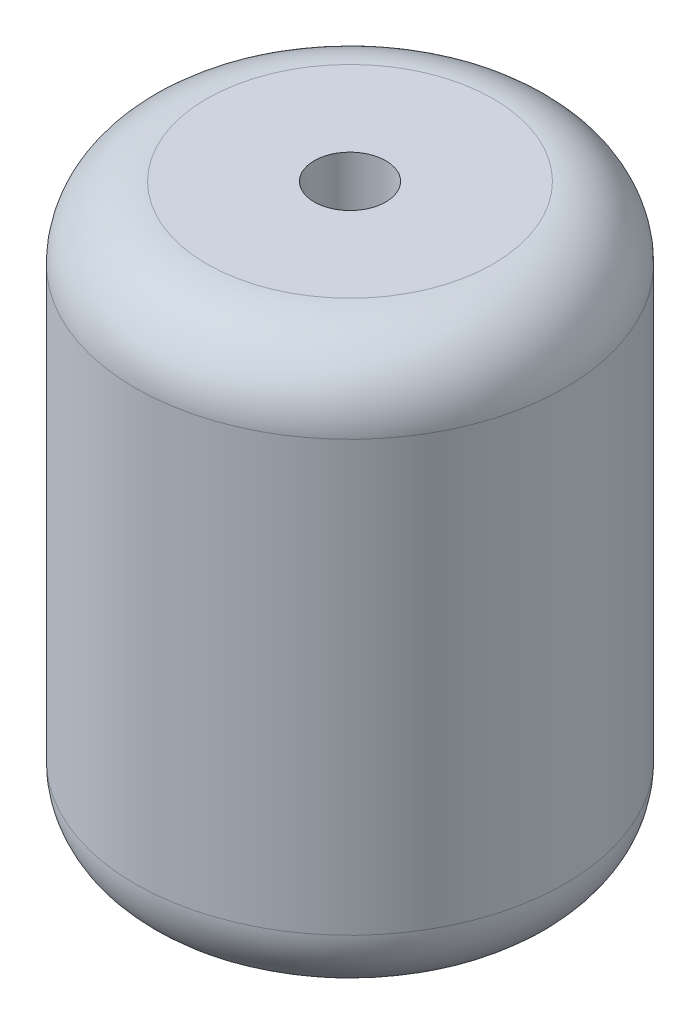
ISO-10303-21;
HEADER;
FILE_DESCRIPTION(('STEP AP214'),'2;1');
FILE_NAME('part.step','',(''),(''),'','','');
FILE_SCHEMA(('AUTOMOTIVE_DESIGN { 1 0 10303 214 1 1 1 1 }'));
ENDSEC;
DATA;
#1=APPLICATION_CONTEXT('core data for automotive mechanical design processes');
#2=APPLICATION_PROTOCOL_DEFINITION('international standard','automotive_design',2000,#1);
#3=PRODUCT_CONTEXT('',#1,'mechanical');
#4=PRODUCT('Part','Part','',(#3));
#5=PRODUCT_RELATED_PRODUCT_CATEGORY('part','',(#4));
#6=PRODUCT_DEFINITION_FORMATION('','',#4);
#7=PRODUCT_DEFINITION_CONTEXT('part definition',#1,'design');
#8=PRODUCT_DEFINITION('design','',#6,#7);
#9=PRODUCT_DEFINITION_SHAPE('','',#8);
#10=(LENGTH_UNIT() NAMED_UNIT(*) SI_UNIT(.MILLI.,.METRE.));
#11=(NAMED_UNIT(*) PLANE_ANGLE_UNIT() SI_UNIT($,.RADIAN.));
#12=(NAMED_UNIT(*) SI_UNIT($,.STERADIAN.) SOLID_ANGLE_UNIT());
#13=UNCERTAINTY_MEASURE_WITH_UNIT(LENGTH_MEASURE(1.E-05),#10,'distance_accuracy_value','');
#14=(GEOMETRIC_REPRESENTATION_CONTEXT(3) GLOBAL_UNCERTAINTY_ASSIGNED_CONTEXT((#13)) GLOBAL_UNIT_ASSIGNED_CONTEXT((#10,
#11,#12)) REPRESENTATION_CONTEXT('',''));
#15=CARTESIAN_POINT('',(0.,0.,0.));
#16=DIRECTION('',(0.,0.,1.));
#17=DIRECTION('',(1.,0.,0.));
#18=AXIS2_PLACEMENT_3D('',#15,#16,#17);
#19=CARTESIAN_POINT('',(0.,8.,0.));
#20=DIRECTION('',(0.,1.,0.));
#21=DIRECTION('',(0.,0.,1.));
#22=AXIS2_PLACEMENT_3D('',#19,#20,#21);
#23=PLANE('',#22);
#24=CARTESIAN_POINT('',(0.,8.,0.));
#25=DIRECTION('',(0.,1.,0.));
#26=DIRECTION('',(0.,0.,1.));
#27=AXIS2_PLACEMENT_3D('',#24,#25,#26);
#28=CIRCLE('',#27,2.);
#29=CARTESIAN_POINT('',(0.,8.,2.));
#30=VERTEX_POINT('',#29);
#31=EDGE_CURVE('E10',#30,#30,#28,.T.);
#32=ORIENTED_EDGE('',*,*,#31,.T.);
#33=EDGE_LOOP('',(#32));
#34=FACE_BOUND('',#33,.T.);
#35=CARTESIAN_POINT('',(0.,8.,0.));
#36=DIRECTION('',(0.,1.,0.));
#37=DIRECTION('',(0.,0.,1.));
#38=AXIS2_PLACEMENT_3D('',#35,#36,#37);
#39=CIRCLE('',#38,0.5);
#40=CARTESIAN_POINT('',(0.,8.,0.5));
#41=VERTEX_POINT('',#40);
#42=EDGE_CURVE('E54',#41,#41,#39,.T.);
#43=ORIENTED_EDGE('',*,*,#42,.F.);
#44=EDGE_LOOP('',(#43));
#45=FACE_BOUND('',#44,.T.);
#46=ADVANCED_FACE('F34',(#34,#45),#23,.T.);
#47=CARTESIAN_POINT('',(0.,0.,0.));
#48=DIRECTION('',(0.,1.,0.));
#49=DIRECTION('',(0.,0.,1.));
#50=AXIS2_PLACEMENT_3D('',#47,#48,#49);
#51=PLANE('',#50);
#52=CARTESIAN_POINT('',(0.,0.,0.));
#53=DIRECTION('',(0.,1.,0.));
#54=DIRECTION('',(0.,0.,1.));
#55=AXIS2_PLACEMENT_3D('',#52,#53,#54);
#56=CIRCLE('',#55,2.);
#57=CARTESIAN_POINT('',(0.,0.,2.));
#58=VERTEX_POINT('',#57);
#59=EDGE_CURVE('E41',#58,#58,#56,.F.);
#60=ORIENTED_EDGE('',*,*,#59,.T.);
#61=EDGE_LOOP('',(#60));
#62=FACE_BOUND('',#61,.T.);
#63=CARTESIAN_POINT('',(0.,0.,0.));
#64=DIRECTION('',(0.,1.,0.));
#65=DIRECTION('',(0.,0.,1.));
#66=AXIS2_PLACEMENT_3D('',#63,#64,#65);
#67=CIRCLE('',#66,0.5);
#68=CARTESIAN_POINT('',(0.,0.,0.5));
#69=VERTEX_POINT('',#68);
#70=EDGE_CURVE('E55',#69,#69,#67,.T.);
#71=ORIENTED_EDGE('',*,*,#70,.T.);
#72=EDGE_LOOP('',(#71));
#73=FACE_BOUND('',#72,.T.);
#74=ADVANCED_FACE('F65',(#62,#73),#51,.F.);
#75=CARTESIAN_POINT('',(0.,8.,0.));
#76=DIRECTION('',(0.,-1.,0.));
#77=DIRECTION('',(0.,0.,-1.));
#78=AXIS2_PLACEMENT_3D('',#75,#76,#77);
#79=CYLINDRICAL_SURFACE('',#78,3.);
#80=CARTESIAN_POINT('',(0.,1.,0.));
#81=DIRECTION('',(0.,1.,0.));
#82=DIRECTION('',(0.,0.,1.));
#83=AXIS2_PLACEMENT_3D('',#80,#81,#82);
#84=CIRCLE('',#83,3.);
#85=CARTESIAN_POINT('',(0.,1.,3.));
#86=VERTEX_POINT('',#85);
#87=EDGE_CURVE('E45',#86,#86,#84,.T.);
#88=ORIENTED_EDGE('',*,*,#87,.T.);
#89=EDGE_LOOP('',(#88));
#90=FACE_BOUND('',#89,.T.);
#91=CARTESIAN_POINT('',(0.,7.,0.));
#92=DIRECTION('',(0.,1.,0.));
#93=DIRECTION('',(0.,0.,1.));
#94=AXIS2_PLACEMENT_3D('',#91,#92,#93);
#95=CIRCLE('',#94,3.);
#96=CARTESIAN_POINT('',(0.,7.,3.));
#97=VERTEX_POINT('',#96);
#98=EDGE_CURVE('E49',#97,#97,#95,.F.);
#99=ORIENTED_EDGE('',*,*,#98,.T.);
#100=EDGE_LOOP('',(#99));
#101=FACE_BOUND('',#100,.T.);
#102=ADVANCED_FACE('F70',(#90,#101),#79,.T.);
#103=CARTESIAN_POINT('',(0.,8.,0.));
#104=DIRECTION('',(0.,-1.,0.));
#105=DIRECTION('',(0.,0.,-1.));
#106=AXIS2_PLACEMENT_3D('',#103,#104,#105);
#107=CYLINDRICAL_SURFACE('',#106,0.5);
#108=ORIENTED_EDGE('',*,*,#42,.T.);
#109=EDGE_LOOP('',(#108));
#110=FACE_BOUND('',#109,.T.);
#111=ORIENTED_EDGE('',*,*,#70,.F.);
#112=EDGE_LOOP('',(#111));
#113=FACE_BOUND('',#112,.T.);
#114=ADVANCED_FACE('F61',(#110,#113),#107,.F.);
#115=CARTESIAN_POINT('',(0.,1.,0.));
#116=DIRECTION('',(0.,1.,0.));
#117=DIRECTION('',(0.,0.,1.));
#118=AXIS2_PLACEMENT_3D('',#115,#116,#117);
#119=TOROIDAL_SURFACE('',#118,2.,1.);
#120=ORIENTED_EDGE('',*,*,#59,.F.);
#121=EDGE_LOOP('',(#120));
#122=FACE_BOUND('',#121,.T.);
#123=ORIENTED_EDGE('',*,*,#87,.F.);
#124=EDGE_LOOP('',(#123));
#125=FACE_BOUND('',#124,.T.);
#126=ADVANCED_FACE('F76',(#122,#125),#119,.T.);
#127=CARTESIAN_POINT('',(0.,7.,0.));
#128=DIRECTION('',(0.,1.,0.));
#129=DIRECTION('',(0.,0.,1.));
#130=AXIS2_PLACEMENT_3D('',#127,#128,#129);
#131=TOROIDAL_SURFACE('',#130,2.,1.);
#132=ORIENTED_EDGE('',*,*,#98,.F.);
#133=EDGE_LOOP('',(#132));
#134=FACE_BOUND('',#133,.T.);
#135=ORIENTED_EDGE('',*,*,#31,.F.);
#136=EDGE_LOOP('',(#135));
#137=FACE_BOUND('',#136,.T.);
#138=ADVANCED_FACE('F36',(#134,#137),#131,.T.);
#139=CLOSED_SHELL('',(#46,#74,#102,#114,#126,#138));
#140=MANIFOLD_SOLID_BREP('B2',#139);
#141=ADVANCED_BREP_SHAPE_REPRESENTATION('',(#18,#140),#14);
#142=SHAPE_DEFINITION_REPRESENTATION(#9,#141);
ENDSEC;
END-ISO-10303-21;
